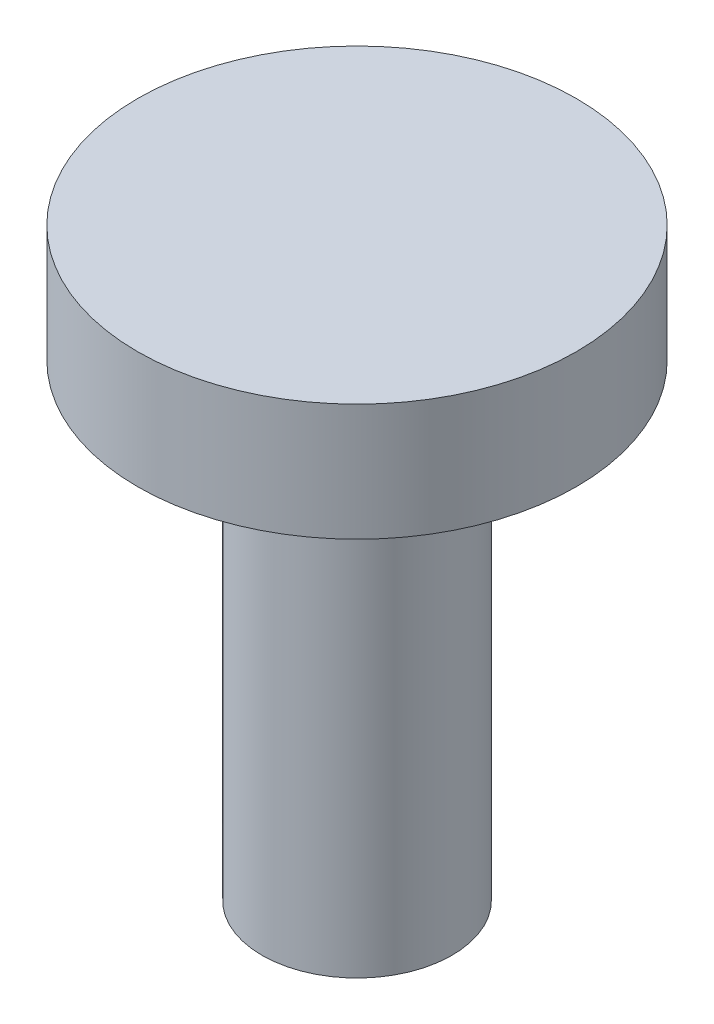
ISO-10303-21;
HEADER;
FILE_DESCRIPTION(('STEP AP214'),'2;1');
FILE_NAME('part.step','',(''),(''),'','','');
FILE_SCHEMA(('AUTOMOTIVE_DESIGN { 1 0 10303 214 1 1 1 1 }'));
ENDSEC;
DATA;
#1=APPLICATION_CONTEXT('core data for automotive mechanical design processes');
#2=APPLICATION_PROTOCOL_DEFINITION('international standard','automotive_design',2000,#1);
#3=PRODUCT_CONTEXT('',#1,'mechanical');
#4=PRODUCT('Part','Part','',(#3));
#5=PRODUCT_RELATED_PRODUCT_CATEGORY('part','',(#4));
#6=PRODUCT_DEFINITION_FORMATION('','',#4);
#7=PRODUCT_DEFINITION_CONTEXT('part definition',#1,'design');
#8=PRODUCT_DEFINITION('design','',#6,#7);
#9=PRODUCT_DEFINITION_SHAPE('','',#8);
#10=(LENGTH_UNIT() NAMED_UNIT(*) SI_UNIT(.MILLI.,.METRE.));
#11=(NAMED_UNIT(*) PLANE_ANGLE_UNIT() SI_UNIT($,.RADIAN.));
#12=(NAMED_UNIT(*) SI_UNIT($,.STERADIAN.) SOLID_ANGLE_UNIT());
#13=UNCERTAINTY_MEASURE_WITH_UNIT(LENGTH_MEASURE(1.E-05),#10,'distance_accuracy_value','');
#14=(GEOMETRIC_REPRESENTATION_CONTEXT(3) GLOBAL_UNCERTAINTY_ASSIGNED_CONTEXT((#13)) GLOBAL_UNIT_ASSIGNED_CONTEXT((#10,
#11,#12)) REPRESENTATION_CONTEXT('',''));
#15=CARTESIAN_POINT('',(0.,0.,0.));
#16=DIRECTION('',(0.,0.,1.));
#17=DIRECTION('',(1.,0.,0.));
#18=AXIS2_PLACEMENT_3D('',#15,#16,#17);
#19=CARTESIAN_POINT('',(0.,16.,0.));
#20=DIRECTION('',(0.,-1.,0.));
#21=DIRECTION('',(0.,0.,-1.));
#22=AXIS2_PLACEMENT_3D('',#19,#20,#21);
#23=CYLINDRICAL_SURFACE('',#22,3.25);
#24=CARTESIAN_POINT('',(0.,16.,0.));
#25=DIRECTION('',(0.,1.,0.));
#26=DIRECTION('',(0.,0.,1.));
#27=AXIS2_PLACEMENT_3D('',#24,#25,#26);
#28=CIRCLE('',#27,3.25);
#29=CARTESIAN_POINT('',(0.,16.,3.25));
#30=VERTEX_POINT('',#29);
#31=EDGE_CURVE('E10',#30,#30,#28,.T.);
#32=ORIENTED_EDGE('',*,*,#31,.F.);
#33=EDGE_LOOP('',(#32));
#34=FACE_BOUND('',#33,.T.);
#35=CARTESIAN_POINT('',(0.,0.,0.));
#36=DIRECTION('',(0.,1.,0.));
#37=DIRECTION('',(0.,0.,1.));
#38=AXIS2_PLACEMENT_3D('',#35,#36,#37);
#39=CIRCLE('',#38,3.25);
#40=CARTESIAN_POINT('',(0.,0.,3.25));
#41=VERTEX_POINT('',#40);
#42=EDGE_CURVE('E44',#41,#41,#39,.T.);
#43=ORIENTED_EDGE('',*,*,#42,.T.);
#44=EDGE_LOOP('',(#43));
#45=FACE_BOUND('',#44,.T.);
#46=ADVANCED_FACE('F41',(#34,#45),#23,.T.);
#47=CARTESIAN_POINT('',(0.,0.,0.));
#48=DIRECTION('',(0.,1.,0.));
#49=DIRECTION('',(0.,0.,1.));
#50=AXIS2_PLACEMENT_3D('',#47,#48,#49);
#51=PLANE('',#50);
#52=ORIENTED_EDGE('',*,*,#42,.F.);
#53=EDGE_LOOP('',(#52));
#54=FACE_BOUND('',#53,.T.);
#55=ADVANCED_FACE('F64',(#54),#51,.F.);
#56=CARTESIAN_POINT('',(0.,20.,0.));
#57=DIRECTION('',(0.,-1.,0.));
#58=DIRECTION('',(0.,0.,-1.));
#59=AXIS2_PLACEMENT_3D('',#56,#57,#58);
#60=CYLINDRICAL_SURFACE('',#59,7.5);
#61=CARTESIAN_POINT('',(0.,20.,0.));
#62=DIRECTION('',(0.,1.,0.));
#63=DIRECTION('',(0.,0.,1.));
#64=AXIS2_PLACEMENT_3D('',#61,#62,#63);
#65=CIRCLE('',#64,7.5);
#66=CARTESIAN_POINT('',(0.,20.,7.5));
#67=VERTEX_POINT('',#66);
#68=EDGE_CURVE('E51',#67,#67,#65,.T.);
#69=ORIENTED_EDGE('',*,*,#68,.F.);
#70=EDGE_LOOP('',(#69));
#71=FACE_BOUND('',#70,.T.);
#72=CARTESIAN_POINT('',(0.,16.,0.));
#73=DIRECTION('',(0.,1.,0.));
#74=DIRECTION('',(0.,0.,1.));
#75=AXIS2_PLACEMENT_3D('',#72,#73,#74);
#76=CIRCLE('',#75,7.5);
#77=CARTESIAN_POINT('',(0.,16.,7.5));
#78=VERTEX_POINT('',#77);
#79=EDGE_CURVE('E53',#78,#78,#76,.T.);
#80=ORIENTED_EDGE('',*,*,#79,.T.);
#81=EDGE_LOOP('',(#80));
#82=FACE_BOUND('',#81,.T.);
#83=ADVANCED_FACE('F61',(#71,#82),#60,.T.);
#84=CARTESIAN_POINT('',(0.,20.,0.));
#85=DIRECTION('',(0.,1.,0.));
#86=DIRECTION('',(0.,0.,1.));
#87=AXIS2_PLACEMENT_3D('',#84,#85,#86);
#88=PLANE('',#87);
#89=ORIENTED_EDGE('',*,*,#68,.T.);
#90=EDGE_LOOP('',(#89));
#91=FACE_BOUND('',#90,.T.);
#92=ADVANCED_FACE('F59',(#91),#88,.T.);
#93=CARTESIAN_POINT('',(0.,16.,0.));
#94=DIRECTION('',(0.,1.,0.));
#95=DIRECTION('',(0.,0.,1.));
#96=AXIS2_PLACEMENT_3D('',#93,#94,#95);
#97=PLANE('',#96);
#98=ORIENTED_EDGE('',*,*,#31,.T.);
#99=EDGE_LOOP('',(#98));
#100=FACE_BOUND('',#99,.T.);
#101=ORIENTED_EDGE('',*,*,#79,.F.);
#102=EDGE_LOOP('',(#101));
#103=FACE_BOUND('',#102,.T.);
#104=ADVANCED_FACE('F68',(#100,#103),#97,.F.);
#105=CLOSED_SHELL('',(#46,#55,#83,#92,#104));
#106=MANIFOLD_SOLID_BREP('B2',#105);
#107=ADVANCED_BREP_SHAPE_REPRESENTATION('',(#18,#106),#14);
#108=SHAPE_DEFINITION_REPRESENTATION(#9,#107);
ENDSEC;
END-ISO-10303-21;
